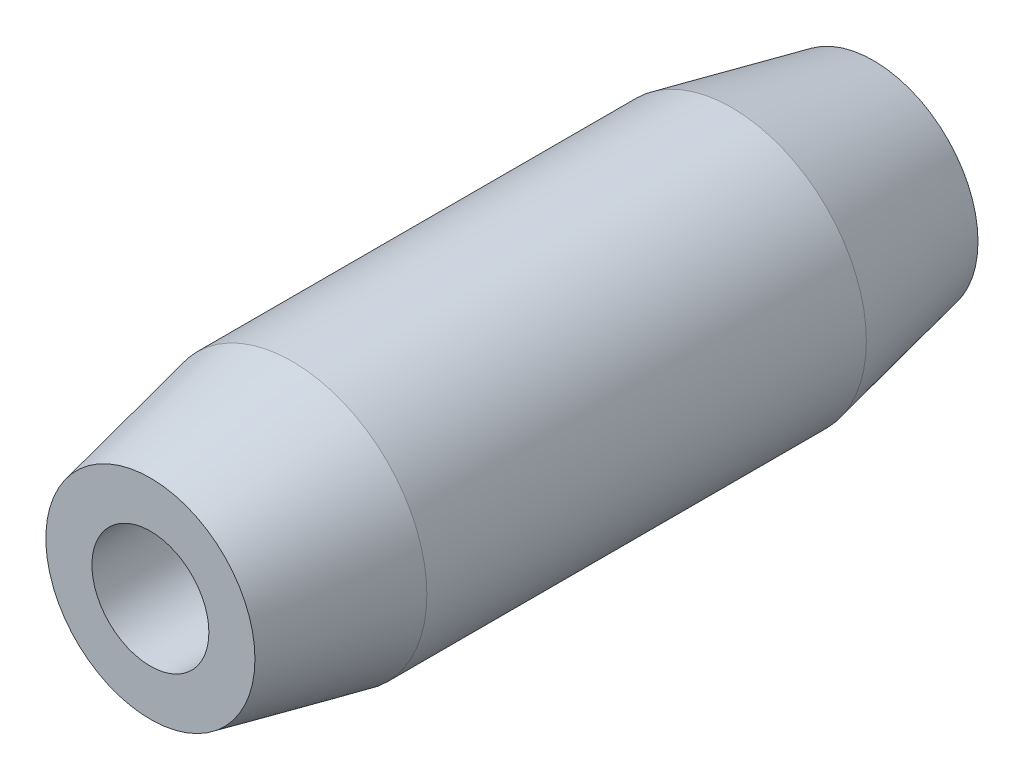
ISO-10303-21;
HEADER;
FILE_DESCRIPTION(('STEP AP214'),'2;1');
FILE_NAME('part.step','',(''),(''),'','','');
FILE_SCHEMA(('AUTOMOTIVE_DESIGN { 1 0 10303 214 1 1 1 1 }'));
ENDSEC;
DATA;
#1=APPLICATION_CONTEXT('core data for automotive mechanical design processes');
#2=APPLICATION_PROTOCOL_DEFINITION('international standard','automotive_design',2000,#1);
#3=PRODUCT_CONTEXT('',#1,'mechanical');
#4=PRODUCT('Part','Part','',(#3));
#5=PRODUCT_RELATED_PRODUCT_CATEGORY('part','',(#4));
#6=PRODUCT_DEFINITION_FORMATION('','',#4);
#7=PRODUCT_DEFINITION_CONTEXT('part definition',#1,'design');
#8=PRODUCT_DEFINITION('design','',#6,#7);
#9=PRODUCT_DEFINITION_SHAPE('','',#8);
#10=(LENGTH_UNIT() NAMED_UNIT(*) SI_UNIT(.MILLI.,.METRE.));
#11=(NAMED_UNIT(*) PLANE_ANGLE_UNIT() SI_UNIT($,.RADIAN.));
#12=(NAMED_UNIT(*) SI_UNIT($,.STERADIAN.) SOLID_ANGLE_UNIT());
#13=UNCERTAINTY_MEASURE_WITH_UNIT(LENGTH_MEASURE(1.E-05),#10,'distance_accuracy_value','');
#14=(GEOMETRIC_REPRESENTATION_CONTEXT(3) GLOBAL_UNCERTAINTY_ASSIGNED_CONTEXT((#13)) GLOBAL_UNIT_ASSIGNED_CONTEXT((#10,
#11,#12)) REPRESENTATION_CONTEXT('',''));
#15=CARTESIAN_POINT('',(0.,0.,0.));
#16=DIRECTION('',(0.,0.,1.));
#17=DIRECTION('',(1.,0.,0.));
#18=AXIS2_PLACEMENT_3D('',#15,#16,#17);
#19=CARTESIAN_POINT('',(0.,0.,20.4));
#20=DIRECTION('',(0.,0.,1.));
#21=DIRECTION('',(1.,0.,0.));
#22=AXIS2_PLACEMENT_3D('',#19,#20,#21);
#23=PLANE('',#22);
#24=CARTESIAN_POINT('',(0.,0.,20.4));
#25=DIRECTION('',(0.,0.,1.));
#26=DIRECTION('',(1.,0.,0.));
#27=AXIS2_PLACEMENT_3D('',#24,#25,#26);
#28=CIRCLE('',#27,2.94977375331991);
#29=CARTESIAN_POINT('',(2.94977375331991,0.,20.4));
#30=VERTEX_POINT('',#29);
#31=EDGE_CURVE('E48',#30,#30,#28,.T.);
#32=ORIENTED_EDGE('',*,*,#31,.T.);
#33=EDGE_LOOP('',(#32));
#34=FACE_BOUND('',#33,.T.);
#35=CARTESIAN_POINT('',(0.,0.,20.4));
#36=DIRECTION('',(0.,0.,1.));
#37=DIRECTION('',(1.,0.,0.));
#38=AXIS2_PLACEMENT_3D('',#35,#36,#37);
#39=CIRCLE('',#38,1.65);
#40=CARTESIAN_POINT('',(1.65,0.,20.4));
#41=VERTEX_POINT('',#40);
#42=EDGE_CURVE('E53',#41,#41,#39,.T.);
#43=ORIENTED_EDGE('',*,*,#42,.F.);
#44=EDGE_LOOP('',(#43));
#45=FACE_BOUND('',#44,.T.);
#46=ADVANCED_FACE('F33',(#34,#45),#23,.T.);
#47=CARTESIAN_POINT('',(0.,0.,0.));
#48=DIRECTION('',(0.,0.,1.));
#49=DIRECTION('',(1.,0.,0.));
#50=AXIS2_PLACEMENT_3D('',#47,#48,#49);
#51=PLANE('',#50);
#52=CARTESIAN_POINT('',(0.,0.,0.));
#53=DIRECTION('',(0.,0.,1.));
#54=DIRECTION('',(1.,0.,0.));
#55=AXIS2_PLACEMENT_3D('',#52,#53,#54);
#56=CIRCLE('',#55,2.94977375331991);
#57=CARTESIAN_POINT('',(2.94977375331991,0.,0.));
#58=VERTEX_POINT('',#57);
#59=EDGE_CURVE('E10',#58,#58,#56,.F.);
#60=ORIENTED_EDGE('',*,*,#59,.T.);
#61=EDGE_LOOP('',(#60));
#62=FACE_BOUND('',#61,.T.);
#63=CARTESIAN_POINT('',(0.,0.,0.));
#64=DIRECTION('',(0.,0.,1.));
#65=DIRECTION('',(1.,0.,0.));
#66=AXIS2_PLACEMENT_3D('',#63,#64,#65);
#67=CIRCLE('',#66,1.65);
#68=CARTESIAN_POINT('',(1.65,0.,0.));
#69=VERTEX_POINT('',#68);
#70=EDGE_CURVE('E54',#69,#69,#67,.T.);
#71=ORIENTED_EDGE('',*,*,#70,.T.);
#72=EDGE_LOOP('',(#71));
#73=FACE_BOUND('',#72,.T.);
#74=ADVANCED_FACE('F67',(#62,#73),#51,.F.);
#75=CARTESIAN_POINT('',(0.,0.,20.4));
#76=DIRECTION('',(0.,0.,-1.));
#77=DIRECTION('',(-1.,0.,0.));
#78=AXIS2_PLACEMENT_3D('',#75,#76,#77);
#79=CYLINDRICAL_SURFACE('',#78,3.8);
#80=CARTESIAN_POINT('',(0.,0.,4.00000000000007));
#81=DIRECTION('',(0.,0.,1.));
#82=DIRECTION('',(1.,0.,0.));
#83=AXIS2_PLACEMENT_3D('',#80,#81,#82);
#84=CIRCLE('',#83,3.8);
#85=CARTESIAN_POINT('',(3.8,0.,4.00000000000007));
#86=VERTEX_POINT('',#85);
#87=EDGE_CURVE('E40',#86,#86,#84,.T.);
#88=ORIENTED_EDGE('',*,*,#87,.T.);
#89=EDGE_LOOP('',(#88));
#90=FACE_BOUND('',#89,.T.);
#91=CARTESIAN_POINT('',(0.,0.,16.3999999999999));
#92=DIRECTION('',(0.,0.,1.));
#93=DIRECTION('',(1.,0.,0.));
#94=AXIS2_PLACEMENT_3D('',#91,#92,#93);
#95=CIRCLE('',#94,3.8);
#96=CARTESIAN_POINT('',(3.8,0.,16.3999999999999));
#97=VERTEX_POINT('',#96);
#98=EDGE_CURVE('E44',#97,#97,#95,.F.);
#99=ORIENTED_EDGE('',*,*,#98,.T.);
#100=EDGE_LOOP('',(#99));
#101=FACE_BOUND('',#100,.T.);
#102=ADVANCED_FACE('F73',(#90,#101),#79,.T.);
#103=CARTESIAN_POINT('',(0.,0.,20.4));
#104=DIRECTION('',(0.,0.,-1.));
#105=DIRECTION('',(-1.,0.,0.));
#106=AXIS2_PLACEMENT_3D('',#103,#104,#105);
#107=CYLINDRICAL_SURFACE('',#106,1.65);
#108=ORIENTED_EDGE('',*,*,#42,.T.);
#109=EDGE_LOOP('',(#108));
#110=FACE_BOUND('',#109,.T.);
#111=ORIENTED_EDGE('',*,*,#70,.F.);
#112=EDGE_LOOP('',(#111));
#113=FACE_BOUND('',#112,.T.);
#114=ADVANCED_FACE('F63',(#110,#113),#107,.F.);
#115=CARTESIAN_POINT('',(0.,0.,20.4));
#116=DIRECTION('',(0.,0.,-1.));
#117=DIRECTION('',(-1.,0.,0.));
#118=AXIS2_PLACEMENT_3D('',#115,#116,#117);
#119=CONICAL_SURFACE('',#118,2.94977375331991,0.209439510239316);
#120=ORIENTED_EDGE('',*,*,#98,.F.);
#121=EDGE_LOOP('',(#120));
#122=FACE_BOUND('',#121,.T.);
#123=ORIENTED_EDGE('',*,*,#31,.F.);
#124=EDGE_LOOP('',(#123));
#125=FACE_BOUND('',#124,.T.);
#126=ADVANCED_FACE('F78',(#122,#125),#119,.T.);
#127=CARTESIAN_POINT('',(0.,0.,4.00000000000007));
#128=DIRECTION('',(0.,0.,1.));
#129=DIRECTION('',(1.,0.,0.));
#130=AXIS2_PLACEMENT_3D('',#127,#128,#129);
#131=CONICAL_SURFACE('',#130,3.8,0.209439510239316);
#132=ORIENTED_EDGE('',*,*,#59,.F.);
#133=EDGE_LOOP('',(#132));
#134=FACE_BOUND('',#133,.T.);
#135=ORIENTED_EDGE('',*,*,#87,.F.);
#136=EDGE_LOOP('',(#135));
#137=FACE_BOUND('',#136,.T.);
#138=ADVANCED_FACE('F35',(#134,#137),#131,.T.);
#139=CLOSED_SHELL('',(#46,#74,#102,#114,#126,#138));
#140=MANIFOLD_SOLID_BREP('B2',#139);
#141=ADVANCED_BREP_SHAPE_REPRESENTATION('',(#18,#140),#14);
#142=SHAPE_DEFINITION_REPRESENTATION(#9,#141);
ENDSEC;
END-ISO-10303-21;
